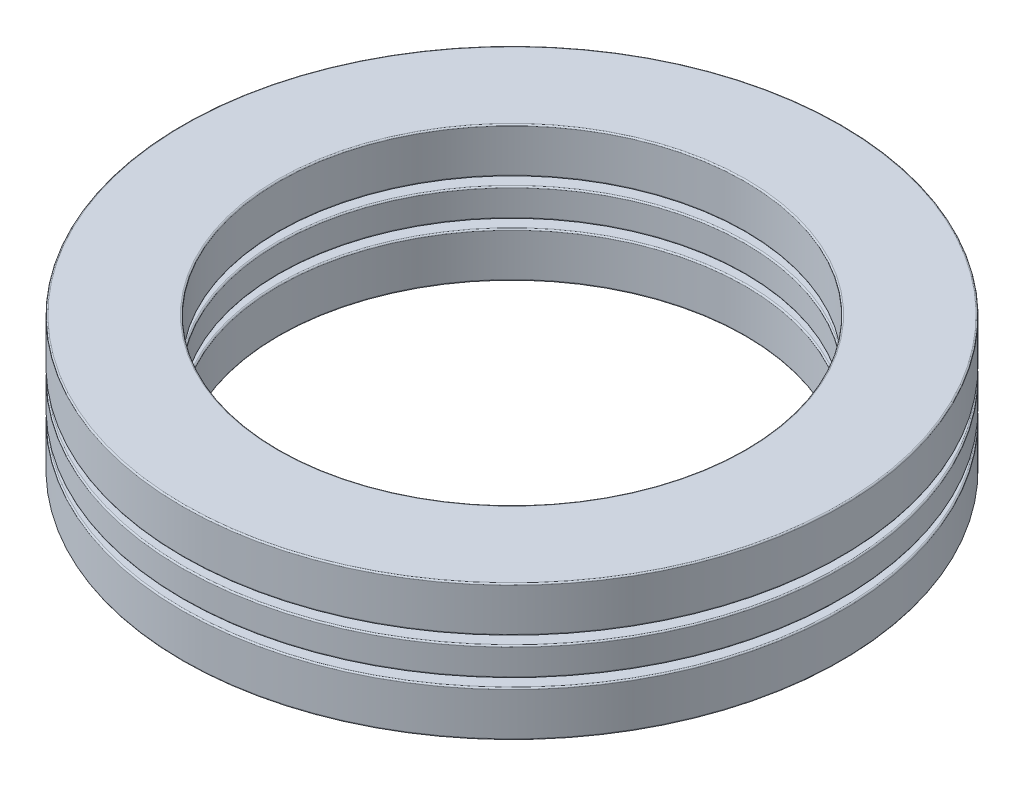
ISO-10303-21;
HEADER;
FILE_DESCRIPTION(('STEP AP214'),'2;1');
FILE_NAME('part.step','',(''),(''),'','','');
FILE_SCHEMA(('AUTOMOTIVE_DESIGN { 1 0 10303 214 1 1 1 1 }'));
ENDSEC;
DATA;
#1=APPLICATION_CONTEXT('core data for automotive mechanical design processes');
#2=APPLICATION_PROTOCOL_DEFINITION('international standard','automotive_design',2000,#1);
#3=PRODUCT_CONTEXT('',#1,'mechanical');
#4=PRODUCT('Part','Part','',(#3));
#5=PRODUCT_RELATED_PRODUCT_CATEGORY('part','',(#4));
#6=PRODUCT_DEFINITION_FORMATION('','',#4);
#7=PRODUCT_DEFINITION_CONTEXT('part definition',#1,'design');
#8=PRODUCT_DEFINITION('design','',#6,#7);
#9=PRODUCT_DEFINITION_SHAPE('','',#8);
#10=(LENGTH_UNIT() NAMED_UNIT(*) SI_UNIT(.MILLI.,.METRE.));
#11=(NAMED_UNIT(*) PLANE_ANGLE_UNIT() SI_UNIT($,.RADIAN.));
#12=(NAMED_UNIT(*) SI_UNIT($,.STERADIAN.) SOLID_ANGLE_UNIT());
#13=UNCERTAINTY_MEASURE_WITH_UNIT(LENGTH_MEASURE(1.E-05),#10,'distance_accuracy_value','');
#14=(GEOMETRIC_REPRESENTATION_CONTEXT(3) GLOBAL_UNCERTAINTY_ASSIGNED_CONTEXT((#13)) GLOBAL_UNIT_ASSIGNED_CONTEXT((#10,
#11,#12)) REPRESENTATION_CONTEXT('',''));
#15=CARTESIAN_POINT('',(0.,0.,0.));
#16=DIRECTION('',(0.,0.,1.));
#17=DIRECTION('',(1.,0.,0.));
#18=AXIS2_PLACEMENT_3D('',#15,#16,#17);
#19=CARTESIAN_POINT('',(0.,-5.5499,0.));
#20=DIRECTION('',(0.,-1.,0.));
#21=DIRECTION('',(0.,0.,-1.));
#22=AXIS2_PLACEMENT_3D('',#19,#20,#21);
#23=CYLINDRICAL_SURFACE('',#22,26.9875);
#24=CARTESIAN_POINT('',(0.,-5.438902,0.));
#25=DIRECTION('',(0.,1.,0.));
#26=DIRECTION('',(0.,0.,1.));
#27=AXIS2_PLACEMENT_3D('',#24,#25,#26);
#28=CIRCLE('',#27,26.9875);
#29=CARTESIAN_POINT('',(0.,-5.438902,26.9875));
#30=VERTEX_POINT('',#29);
#31=EDGE_CURVE('E11',#30,#30,#28,.T.);
#32=ORIENTED_EDGE('',*,*,#31,.T.);
#33=EDGE_LOOP('',(#32));
#34=FACE_BOUND('',#33,.T.);
#35=CARTESIAN_POINT('',(0.,-1.96096466666667,0.));
#36=DIRECTION('',(0.,-1.,0.));
#37=DIRECTION('',(0.,0.,-1.));
#38=AXIS2_PLACEMENT_3D('',#35,#36,#37);
#39=CIRCLE('',#38,26.9875);
#40=CARTESIAN_POINT('',(0.,-1.96096466666667,-26.9875));
#41=VERTEX_POINT('',#40);
#42=EDGE_CURVE('E48',#41,#41,#39,.T.);
#43=ORIENTED_EDGE('',*,*,#42,.T.);
#44=EDGE_LOOP('',(#43));
#45=FACE_BOUND('',#44,.T.);
#46=ADVANCED_FACE('F41',(#34,#45),#23,.T.);
#47=CARTESIAN_POINT('',(0.,-1.84996666666667,26.9875));
#48=DIRECTION('',(0.,-1.,0.));
#49=DIRECTION('',(0.,0.,-1.));
#50=AXIS2_PLACEMENT_3D('',#47,#48,#49);
#51=PLANE('',#50);
#52=CARTESIAN_POINT('',(0.,-1.84996666666667,0.));
#53=DIRECTION('',(0.,-1.,0.));
#54=DIRECTION('',(0.,0.,-1.));
#55=AXIS2_PLACEMENT_3D('',#52,#53,#54);
#56=CIRCLE('',#55,19.199098);
#57=CARTESIAN_POINT('',(0.,-1.84996666666667,-19.199098));
#58=VERTEX_POINT('',#57);
#59=EDGE_CURVE('E52',#58,#58,#56,.T.);
#60=ORIENTED_EDGE('',*,*,#59,.T.);
#61=EDGE_LOOP('',(#60));
#62=FACE_BOUND('',#61,.T.);
#63=CARTESIAN_POINT('',(0.,-1.84996666666667,0.));
#64=DIRECTION('',(0.,-1.,0.));
#65=DIRECTION('',(0.,0.,-1.));
#66=AXIS2_PLACEMENT_3D('',#63,#64,#65);
#67=CIRCLE('',#66,26.876502);
#68=CARTESIAN_POINT('',(0.,-1.84996666666667,-26.876502));
#69=VERTEX_POINT('',#68);
#70=EDGE_CURVE('E56',#69,#69,#67,.F.);
#71=ORIENTED_EDGE('',*,*,#70,.T.);
#72=EDGE_LOOP('',(#71));
#73=FACE_BOUND('',#72,.T.);
#74=ADVANCED_FACE('F84',(#62,#73),#51,.F.);
#75=CARTESIAN_POINT('',(0.,-5.5499,0.));
#76=DIRECTION('',(0.,-1.,0.));
#77=DIRECTION('',(0.,0.,-1.));
#78=AXIS2_PLACEMENT_3D('',#75,#76,#77);
#79=CYLINDRICAL_SURFACE('',#78,19.0881);
#80=CARTESIAN_POINT('',(0.,-5.438902,0.));
#81=DIRECTION('',(0.,1.,0.));
#82=DIRECTION('',(0.,0.,1.));
#83=AXIS2_PLACEMENT_3D('',#80,#81,#82);
#84=CIRCLE('',#83,19.0881);
#85=CARTESIAN_POINT('',(0.,-5.438902,19.0881));
#86=VERTEX_POINT('',#85);
#87=EDGE_CURVE('E67',#86,#86,#84,.F.);
#88=ORIENTED_EDGE('',*,*,#87,.T.);
#89=EDGE_LOOP('',(#88));
#90=FACE_BOUND('',#89,.T.);
#91=CARTESIAN_POINT('',(0.,-1.96096466666667,0.));
#92=DIRECTION('',(0.,-1.,0.));
#93=DIRECTION('',(0.,0.,-1.));
#94=AXIS2_PLACEMENT_3D('',#91,#92,#93);
#95=CIRCLE('',#94,19.0881);
#96=CARTESIAN_POINT('',(0.,-1.96096466666667,-19.0881));
#97=VERTEX_POINT('',#96);
#98=EDGE_CURVE('E70',#97,#97,#95,.F.);
#99=ORIENTED_EDGE('',*,*,#98,.T.);
#100=EDGE_LOOP('',(#99));
#101=FACE_BOUND('',#100,.T.);
#102=ADVANCED_FACE('F74',(#90,#101),#79,.F.);
#103=CARTESIAN_POINT('',(0.,-5.5499,26.9875));
#104=DIRECTION('',(0.,1.,0.));
#105=DIRECTION('',(0.,0.,1.));
#106=AXIS2_PLACEMENT_3D('',#103,#104,#105);
#107=PLANE('',#106);
#108=CARTESIAN_POINT('',(0.,-5.5499,0.));
#109=DIRECTION('',(0.,1.,0.));
#110=DIRECTION('',(0.,0.,1.));
#111=AXIS2_PLACEMENT_3D('',#108,#109,#110);
#112=CIRCLE('',#111,19.199098);
#113=CARTESIAN_POINT('',(0.,-5.5499,19.199098));
#114=VERTEX_POINT('',#113);
#115=EDGE_CURVE('E61',#114,#114,#112,.T.);
#116=ORIENTED_EDGE('',*,*,#115,.T.);
#117=EDGE_LOOP('',(#116));
#118=FACE_BOUND('',#117,.T.);
#119=CARTESIAN_POINT('',(0.,-5.5499,0.));
#120=DIRECTION('',(0.,1.,0.));
#121=DIRECTION('',(0.,0.,1.));
#122=AXIS2_PLACEMENT_3D('',#119,#120,#121);
#123=CIRCLE('',#122,26.876502);
#124=CARTESIAN_POINT('',(0.,-5.5499,26.876502));
#125=VERTEX_POINT('',#124);
#126=EDGE_CURVE('E64',#125,#125,#123,.F.);
#127=ORIENTED_EDGE('',*,*,#126,.T.);
#128=EDGE_LOOP('',(#127));
#129=FACE_BOUND('',#128,.T.);
#130=ADVANCED_FACE('F103',(#118,#129),#107,.F.);
#131=CARTESIAN_POINT('',(0.,-5.438902,0.));
#132=DIRECTION('',(0.,1.,0.));
#133=DIRECTION('',(0.,0.,1.));
#134=AXIS2_PLACEMENT_3D('',#131,#132,#133);
#135=TOROIDAL_SURFACE('',#134,19.199098,0.110998);
#136=ORIENTED_EDGE('',*,*,#115,.F.);
#137=EDGE_LOOP('',(#136));
#138=FACE_BOUND('',#137,.T.);
#139=ORIENTED_EDGE('',*,*,#87,.F.);
#140=EDGE_LOOP('',(#139));
#141=FACE_BOUND('',#140,.T.);
#142=ADVANCED_FACE('F80',(#138,#141),#135,.T.);
#143=CARTESIAN_POINT('',(0.,-1.96096466666667,0.));
#144=DIRECTION('',(0.,-1.,0.));
#145=DIRECTION('',(0.,0.,-1.));
#146=AXIS2_PLACEMENT_3D('',#143,#144,#145);
#147=TOROIDAL_SURFACE('',#146,19.199098,0.110998);
#148=ORIENTED_EDGE('',*,*,#98,.F.);
#149=EDGE_LOOP('',(#148));
#150=FACE_BOUND('',#149,.T.);
#151=ORIENTED_EDGE('',*,*,#59,.F.);
#152=EDGE_LOOP('',(#151));
#153=FACE_BOUND('',#152,.T.);
#154=ADVANCED_FACE('F76',(#150,#153),#147,.T.);
#155=CARTESIAN_POINT('',(0.,-5.438902,0.));
#156=DIRECTION('',(0.,1.,0.));
#157=DIRECTION('',(0.,0.,1.));
#158=AXIS2_PLACEMENT_3D('',#155,#156,#157);
#159=TOROIDAL_SURFACE('',#158,26.876502,0.110998);
#160=ORIENTED_EDGE('',*,*,#31,.F.);
#161=EDGE_LOOP('',(#160));
#162=FACE_BOUND('',#161,.T.);
#163=ORIENTED_EDGE('',*,*,#126,.F.);
#164=EDGE_LOOP('',(#163));
#165=FACE_BOUND('',#164,.T.);
#166=ADVANCED_FACE('F79',(#162,#165),#159,.T.);
#167=CARTESIAN_POINT('',(0.,-1.96096466666667,0.));
#168=DIRECTION('',(0.,-1.,0.));
#169=DIRECTION('',(0.,0.,-1.));
#170=AXIS2_PLACEMENT_3D('',#167,#168,#169);
#171=TOROIDAL_SURFACE('',#170,26.876502,0.110998);
#172=ORIENTED_EDGE('',*,*,#70,.F.);
#173=EDGE_LOOP('',(#172));
#174=FACE_BOUND('',#173,.T.);
#175=ORIENTED_EDGE('',*,*,#42,.F.);
#176=EDGE_LOOP('',(#175));
#177=FACE_BOUND('',#176,.T.);
#178=ADVANCED_FACE('F43',(#174,#177),#171,.T.);
#179=CLOSED_SHELL('',(#46,#74,#102,#130,#142,#154,#166,#178));
#180=MANIFOLD_SOLID_BREP('B2',#179);
#181=CARTESIAN_POINT('',(0.,-5.5499,0.));
#182=DIRECTION('',(0.,-1.,0.));
#183=DIRECTION('',(0.,0.,-1.));
#184=AXIS2_PLACEMENT_3D('',#181,#182,#183);
#185=CYLINDRICAL_SURFACE('',#184,26.9875);
#186=CARTESIAN_POINT('',(0.,1.96096466666667,0.));
#187=DIRECTION('',(0.,1.,0.));
#188=DIRECTION('',(0.,0.,1.));
#189=AXIS2_PLACEMENT_3D('',#186,#187,#188);
#190=CIRCLE('',#189,26.9875);
#191=CARTESIAN_POINT('',(0.,1.96096466666667,26.9875));
#192=VERTEX_POINT('',#191);
#193=EDGE_CURVE('E40',#192,#192,#190,.T.);
#194=ORIENTED_EDGE('',*,*,#193,.T.);
#195=EDGE_LOOP('',(#194));
#196=FACE_BOUND('',#195,.T.);
#197=CARTESIAN_POINT('',(0.,5.438902,0.));
#198=DIRECTION('',(0.,-1.,0.));
#199=DIRECTION('',(0.,0.,-1.));
#200=AXIS2_PLACEMENT_3D('',#197,#198,#199);
#201=CIRCLE('',#200,26.9875);
#202=CARTESIAN_POINT('',(0.,5.438902,-26.9875));
#203=VERTEX_POINT('',#202);
#204=EDGE_CURVE('E175',#203,#203,#201,.T.);
#205=ORIENTED_EDGE('',*,*,#204,.T.);
#206=EDGE_LOOP('',(#205));
#207=FACE_BOUND('',#206,.T.);
#208=ADVANCED_FACE('F168',(#196,#207),#185,.T.);
#209=CARTESIAN_POINT('',(0.,5.5499,26.9875));
#210=DIRECTION('',(0.,-1.,0.));
#211=DIRECTION('',(0.,0.,-1.));
#212=AXIS2_PLACEMENT_3D('',#209,#210,#211);
#213=PLANE('',#212);
#214=CARTESIAN_POINT('',(0.,5.5499,0.));
#215=DIRECTION('',(0.,-1.,0.));
#216=DIRECTION('',(0.,0.,-1.));
#217=AXIS2_PLACEMENT_3D('',#214,#215,#216);
#218=CIRCLE('',#217,19.199098);
#219=CARTESIAN_POINT('',(0.,5.5499,-19.199098));
#220=VERTEX_POINT('',#219);
#221=EDGE_CURVE('E179',#220,#220,#218,.T.);
#222=ORIENTED_EDGE('',*,*,#221,.T.);
#223=EDGE_LOOP('',(#222));
#224=FACE_BOUND('',#223,.T.);
#225=CARTESIAN_POINT('',(0.,5.5499,0.));
#226=DIRECTION('',(0.,-1.,0.));
#227=DIRECTION('',(0.,0.,-1.));
#228=AXIS2_PLACEMENT_3D('',#225,#226,#227);
#229=CIRCLE('',#228,26.876502);
#230=CARTESIAN_POINT('',(0.,5.5499,-26.876502));
#231=VERTEX_POINT('',#230);
#232=EDGE_CURVE('E183',#231,#231,#229,.F.);
#233=ORIENTED_EDGE('',*,*,#232,.T.);
#234=EDGE_LOOP('',(#233));
#235=FACE_BOUND('',#234,.T.);
#236=ADVANCED_FACE('F211',(#224,#235),#213,.F.);
#237=CARTESIAN_POINT('',(0.,-5.5499,0.));
#238=DIRECTION('',(0.,-1.,0.));
#239=DIRECTION('',(0.,0.,-1.));
#240=AXIS2_PLACEMENT_3D('',#237,#238,#239);
#241=CYLINDRICAL_SURFACE('',#240,19.0881);
#242=CARTESIAN_POINT('',(0.,1.96096466666667,0.));
#243=DIRECTION('',(0.,1.,0.));
#244=DIRECTION('',(0.,0.,1.));
#245=AXIS2_PLACEMENT_3D('',#242,#243,#244);
#246=CIRCLE('',#245,19.0881);
#247=CARTESIAN_POINT('',(0.,1.96096466666667,19.0881));
#248=VERTEX_POINT('',#247);
#249=EDGE_CURVE('E194',#248,#248,#246,.F.);
#250=ORIENTED_EDGE('',*,*,#249,.T.);
#251=EDGE_LOOP('',(#250));
#252=FACE_BOUND('',#251,.T.);
#253=CARTESIAN_POINT('',(0.,5.438902,0.));
#254=DIRECTION('',(0.,-1.,0.));
#255=DIRECTION('',(0.,0.,-1.));
#256=AXIS2_PLACEMENT_3D('',#253,#254,#255);
#257=CIRCLE('',#256,19.0881);
#258=CARTESIAN_POINT('',(0.,5.438902,-19.0881));
#259=VERTEX_POINT('',#258);
#260=EDGE_CURVE('E197',#259,#259,#257,.F.);
#261=ORIENTED_EDGE('',*,*,#260,.T.);
#262=EDGE_LOOP('',(#261));
#263=FACE_BOUND('',#262,.T.);
#264=ADVANCED_FACE('F201',(#252,#263),#241,.F.);
#265=CARTESIAN_POINT('',(0.,1.84996666666667,26.9875));
#266=DIRECTION('',(0.,1.,0.));
#267=DIRECTION('',(0.,0.,1.));
#268=AXIS2_PLACEMENT_3D('',#265,#266,#267);
#269=PLANE('',#268);
#270=CARTESIAN_POINT('',(0.,1.84996666666667,0.));
#271=DIRECTION('',(0.,1.,0.));
#272=DIRECTION('',(0.,0.,1.));
#273=AXIS2_PLACEMENT_3D('',#270,#271,#272);
#274=CIRCLE('',#273,19.199098);
#275=CARTESIAN_POINT('',(0.,1.84996666666667,19.199098));
#276=VERTEX_POINT('',#275);
#277=EDGE_CURVE('E188',#276,#276,#274,.T.);
#278=ORIENTED_EDGE('',*,*,#277,.T.);
#279=EDGE_LOOP('',(#278));
#280=FACE_BOUND('',#279,.T.);
#281=CARTESIAN_POINT('',(0.,1.84996666666667,0.));
#282=DIRECTION('',(0.,1.,0.));
#283=DIRECTION('',(0.,0.,1.));
#284=AXIS2_PLACEMENT_3D('',#281,#282,#283);
#285=CIRCLE('',#284,26.876502);
#286=CARTESIAN_POINT('',(0.,1.84996666666667,26.876502));
#287=VERTEX_POINT('',#286);
#288=EDGE_CURVE('E191',#287,#287,#285,.F.);
#289=ORIENTED_EDGE('',*,*,#288,.T.);
#290=EDGE_LOOP('',(#289));
#291=FACE_BOUND('',#290,.T.);
#292=ADVANCED_FACE('F230',(#280,#291),#269,.F.);
#293=CARTESIAN_POINT('',(0.,1.96096466666667,0.));
#294=DIRECTION('',(0.,1.,0.));
#295=DIRECTION('',(0.,0.,1.));
#296=AXIS2_PLACEMENT_3D('',#293,#294,#295);
#297=TOROIDAL_SURFACE('',#296,19.199098,0.110998);
#298=ORIENTED_EDGE('',*,*,#277,.F.);
#299=EDGE_LOOP('',(#298));
#300=FACE_BOUND('',#299,.T.);
#301=ORIENTED_EDGE('',*,*,#249,.F.);
#302=EDGE_LOOP('',(#301));
#303=FACE_BOUND('',#302,.T.);
#304=ADVANCED_FACE('F207',(#300,#303),#297,.T.);
#305=CARTESIAN_POINT('',(0.,5.438902,0.));
#306=DIRECTION('',(0.,-1.,0.));
#307=DIRECTION('',(0.,0.,-1.));
#308=AXIS2_PLACEMENT_3D('',#305,#306,#307);
#309=TOROIDAL_SURFACE('',#308,19.199098,0.110998);
#310=ORIENTED_EDGE('',*,*,#260,.F.);
#311=EDGE_LOOP('',(#310));
#312=FACE_BOUND('',#311,.T.);
#313=ORIENTED_EDGE('',*,*,#221,.F.);
#314=EDGE_LOOP('',(#313));
#315=FACE_BOUND('',#314,.T.);
#316=ADVANCED_FACE('F203',(#312,#315),#309,.T.);
#317=CARTESIAN_POINT('',(0.,1.96096466666667,0.));
#318=DIRECTION('',(0.,1.,0.));
#319=DIRECTION('',(0.,0.,1.));
#320=AXIS2_PLACEMENT_3D('',#317,#318,#319);
#321=TOROIDAL_SURFACE('',#320,26.876502,0.110998);
#322=ORIENTED_EDGE('',*,*,#193,.F.);
#323=EDGE_LOOP('',(#322));
#324=FACE_BOUND('',#323,.T.);
#325=ORIENTED_EDGE('',*,*,#288,.F.);
#326=EDGE_LOOP('',(#325));
#327=FACE_BOUND('',#326,.T.);
#328=ADVANCED_FACE('F206',(#324,#327),#321,.T.);
#329=CARTESIAN_POINT('',(0.,5.438902,0.));
#330=DIRECTION('',(0.,-1.,0.));
#331=DIRECTION('',(0.,0.,-1.));
#332=AXIS2_PLACEMENT_3D('',#329,#330,#331);
#333=TOROIDAL_SURFACE('',#332,26.876502,0.110998);
#334=ORIENTED_EDGE('',*,*,#232,.F.);
#335=EDGE_LOOP('',(#334));
#336=FACE_BOUND('',#335,.T.);
#337=ORIENTED_EDGE('',*,*,#204,.F.);
#338=EDGE_LOOP('',(#337));
#339=FACE_BOUND('',#338,.T.);
#340=ADVANCED_FACE('F170',(#336,#339),#333,.T.);
#341=CLOSED_SHELL('',(#208,#236,#264,#292,#304,#316,#328,#340));
#342=MANIFOLD_SOLID_BREP('B6',#341);
#343=CARTESIAN_POINT('',(-12.4551750243783,0.,19.3806306386583));
#344=DIRECTION('',(0.,1.,0.));
#345=DIRECTION('',(0.540640817455587,0.,-0.841253532831188));
#346=AXIS2_PLACEMENT_3D('',#343,#344,#345);
#347=SPHERICAL_SURFACE('',#346,1.84996666666667);
#348=CARTESIAN_POINT('',(-12.4551750243783,1.84996666666667,19.3806306386583));
#349=VERTEX_POINT('',#348);
#350=VERTEX_LOOP('',#349);
#351=FACE_BOUND('',#350,.T.);
#352=ADVANCED_FACE('F295',(#351),#347,.T.);
#353=CLOSED_SHELL('',(#352));
#354=MANIFOLD_SOLID_BREP('B35',#353);
#355=CARTESIAN_POINT('',(-20.9559199825782,0.,9.57024798653509));
#356=DIRECTION('',(0.,1.,0.));
#357=DIRECTION('',(0.909631995354514,0.,-0.415415013001897));
#358=AXIS2_PLACEMENT_3D('',#355,#356,#357);
#359=SPHERICAL_SURFACE('',#358,1.84996666666667);
#360=CARTESIAN_POINT('',(-20.9559199825782,1.84996666666667,9.57024798653509));
#361=VERTEX_POINT('',#360);
#362=VERTEX_LOOP('',#361);
#363=FACE_BOUND('',#362,.T.);
#364=ADVANCED_FACE('F313',(#363),#359,.T.);
#365=CLOSED_SHELL('',(#364));
#366=MANIFOLD_SOLID_BREP('B164',#365);
#367=CARTESIAN_POINT('',(-22.8033084137646,0.,-3.27862078117207));
#368=DIRECTION('',(0.,1.,0.));
#369=DIRECTION('',(0.989821441880934,0.,0.142314838273276));
#370=AXIS2_PLACEMENT_3D('',#367,#368,#369);
#371=SPHERICAL_SURFACE('',#370,1.84996666666667);
#372=CARTESIAN_POINT('',(-22.8033084137646,1.84996666666667,-3.27862078117207));
#373=VERTEX_POINT('',#372);
#374=VERTEX_LOOP('',#373);
#375=FACE_BOUND('',#374,.T.);
#376=ADVANCED_FACE('F331',(#375),#371,.T.);
#377=CLOSED_SHELL('',(#376));
#378=MANIFOLD_SOLID_BREP('B291',#377);
#379=CARTESIAN_POINT('',(-17.4108075440587,0.,-15.0865506164845));
#380=DIRECTION('',(0.,1.,0.));
#381=DIRECTION('',(0.755749574354264,0.,0.654860733945279));
#382=AXIS2_PLACEMENT_3D('',#379,#380,#381);
#383=SPHERICAL_SURFACE('',#382,1.84996666666667);
#384=CARTESIAN_POINT('',(-17.4108075440587,1.84996666666667,-15.0865506164845));
#385=VERTEX_POINT('',#384);
#386=VERTEX_LOOP('',#385);
#387=FACE_BOUND('',#386,.T.);
#388=ADVANCED_FACE('F349',(#387),#383,.T.);
#389=CLOSED_SHELL('',(#388));
#390=MANIFOLD_SOLID_BREP('B309',#389);
#391=CARTESIAN_POINT('',(-6.49049829800165,0.,-22.104607227536));
#392=DIRECTION('',(0.,1.,0.));
#393=DIRECTION('',(0.281732556841437,0.,0.959492973614495));
#394=AXIS2_PLACEMENT_3D('',#391,#392,#393);
#395=SPHERICAL_SURFACE('',#394,1.84996666666667);
#396=CARTESIAN_POINT('',(-6.49049829800165,1.84996666666667,-22.104607227536));
#397=VERTEX_POINT('',#396);
#398=VERTEX_LOOP('',#397);
#399=FACE_BOUND('',#398,.T.);
#400=ADVANCED_FACE('F367',(#399),#395,.T.);
#401=CLOSED_SHELL('',(#400));
#402=MANIFOLD_SOLID_BREP('B327',#401);
#403=CARTESIAN_POINT('',(6.49049829800135,0.,-22.1046072275361));
#404=DIRECTION('',(0.,1.,0.));
#405=DIRECTION('',(-0.281732556841424,0.,0.959492973614499));
#406=AXIS2_PLACEMENT_3D('',#403,#404,#405);
#407=SPHERICAL_SURFACE('',#406,1.84996666666667);
#408=CARTESIAN_POINT('',(6.49049829800135,1.84996666666667,-22.1046072275361));
#409=VERTEX_POINT('',#408);
#410=VERTEX_LOOP('',#409);
#411=FACE_BOUND('',#410,.T.);
#412=ADVANCED_FACE('F385',(#411),#407,.T.);
#413=CLOSED_SHELL('',(#412));
#414=MANIFOLD_SOLID_BREP('B345',#413);
#415=CARTESIAN_POINT('',(17.4108075440585,0.,-15.0865506164848));
#416=DIRECTION('',(0.,1.,0.));
#417=DIRECTION('',(-0.755749574354255,0.,0.654860733945289));
#418=AXIS2_PLACEMENT_3D('',#415,#416,#417);
#419=SPHERICAL_SURFACE('',#418,1.84996666666667);
#420=CARTESIAN_POINT('',(17.4108075440585,1.84996666666667,-15.0865506164848));
#421=VERTEX_POINT('',#420);
#422=VERTEX_LOOP('',#421);
#423=FACE_BOUND('',#422,.T.);
#424=ADVANCED_FACE('F403',(#423),#419,.T.);
#425=CLOSED_SHELL('',(#424));
#426=MANIFOLD_SOLID_BREP('B363',#425);
#427=CARTESIAN_POINT('',(22.8033084137645,0.,-3.27862078117237));
#428=DIRECTION('',(0.,1.,0.));
#429=DIRECTION('',(-0.989821441880932,0.,0.142314838273289));
#430=AXIS2_PLACEMENT_3D('',#427,#428,#429);
#431=SPHERICAL_SURFACE('',#430,1.84996666666667);
#432=CARTESIAN_POINT('',(22.8033084137645,1.84996666666667,-3.27862078117237));
#433=VERTEX_POINT('',#432);
#434=VERTEX_LOOP('',#433);
#435=FACE_BOUND('',#434,.T.);
#436=ADVANCED_FACE('F421',(#435),#431,.T.);
#437=CLOSED_SHELL('',(#436));
#438=MANIFOLD_SOLID_BREP('B381',#437);
#439=CARTESIAN_POINT('',(20.9559199825783,0.,9.57024798653481));
#440=DIRECTION('',(0.,1.,0.));
#441=DIRECTION('',(-0.90963199535452,0.,-0.415415013001884));
#442=AXIS2_PLACEMENT_3D('',#439,#440,#441);
#443=SPHERICAL_SURFACE('',#442,1.84996666666667);
#444=CARTESIAN_POINT('',(20.9559199825783,1.84996666666667,9.57024798653481));
#445=VERTEX_POINT('',#444);
#446=VERTEX_LOOP('',#445);
#447=FACE_BOUND('',#446,.T.);
#448=ADVANCED_FACE('F439',(#447),#443,.T.);
#449=CLOSED_SHELL('',(#448));
#450=MANIFOLD_SOLID_BREP('B399',#449);
#451=CARTESIAN_POINT('',(12.4551750243786,0.,19.3806306386582));
#452=DIRECTION('',(0.,1.,0.));
#453=DIRECTION('',(-0.540640817455599,0.,-0.841253532831181));
#454=AXIS2_PLACEMENT_3D('',#451,#452,#453);
#455=SPHERICAL_SURFACE('',#454,1.84996666666667);
#456=CARTESIAN_POINT('',(12.4551750243786,1.84996666666667,19.3806306386582));
#457=VERTEX_POINT('',#456);
#458=VERTEX_LOOP('',#457);
#459=FACE_BOUND('',#458,.T.);
#460=ADVANCED_FACE('F457',(#459),#455,.T.);
#461=CLOSED_SHELL('',(#460));
#462=MANIFOLD_SOLID_BREP('B417',#461);
#463=CARTESIAN_POINT('',(0.,0.,23.0378));
#464=DIRECTION('',(0.,1.,0.));
#465=DIRECTION('',(0.,0.,-1.));
#466=AXIS2_PLACEMENT_3D('',#463,#464,#465);
#467=SPHERICAL_SURFACE('',#466,1.84996666666667);
#468=CARTESIAN_POINT('',(0.,1.84996666666667,23.0378));
#469=VERTEX_POINT('',#468);
#470=VERTEX_LOOP('',#469);
#471=FACE_BOUND('',#470,.T.);
#472=ADVANCED_FACE('F476',(#471),#467,.T.);
#473=CLOSED_SHELL('',(#472));
#474=MANIFOLD_SOLID_BREP('B435',#473);
#475=CARTESIAN_POINT('',(0.,-5.5499,0.));
#476=DIRECTION('',(0.,-1.,0.));
#477=DIRECTION('',(0.,0.,-1.));
#478=AXIS2_PLACEMENT_3D('',#475,#476,#477);
#479=CYLINDRICAL_SURFACE('',#478,26.9875);
#480=CARTESIAN_POINT('',(0.,-1.04523116666667,0.));
#481=DIRECTION('',(0.,1.,0.));
#482=DIRECTION('',(0.,0.,1.));
#483=AXIS2_PLACEMENT_3D('',#480,#481,#482);
#484=CIRCLE('',#483,26.9875);
#485=CARTESIAN_POINT('',(0.,-1.04523116666667,26.9875));
#486=VERTEX_POINT('',#485);
#487=EDGE_CURVE('E475',#486,#486,#484,.T.);
#488=ORIENTED_EDGE('',*,*,#487,.T.);
#489=EDGE_LOOP('',(#488));
#490=FACE_BOUND('',#489,.T.);
#491=CARTESIAN_POINT('',(0.,1.04523116666667,0.));
#492=DIRECTION('',(0.,-1.,0.));
#493=DIRECTION('',(0.,0.,-1.));
#494=AXIS2_PLACEMENT_3D('',#491,#492,#493);
#495=CIRCLE('',#494,26.9875);
#496=CARTESIAN_POINT('',(0.,1.04523116666667,-26.9875));
#497=VERTEX_POINT('',#496);
#498=EDGE_CURVE('E495',#497,#497,#495,.T.);
#499=ORIENTED_EDGE('',*,*,#498,.T.);
#500=EDGE_LOOP('',(#499));
#501=FACE_BOUND('',#500,.T.);
#502=ADVANCED_FACE('F488',(#490,#501),#479,.T.);
#503=CARTESIAN_POINT('',(0.,-1.15622916666667,26.9875));
#504=DIRECTION('',(0.,1.,0.));
#505=DIRECTION('',(0.,0.,1.));
#506=AXIS2_PLACEMENT_3D('',#503,#504,#505);
#507=PLANE('',#506);
#508=CARTESIAN_POINT('',(0.,-1.15622916666667,0.));
#509=DIRECTION('',(0.,1.,0.));
#510=DIRECTION('',(0.,0.,1.));
#511=AXIS2_PLACEMENT_3D('',#508,#509,#510);
#512=CIRCLE('',#511,19.199098);
#513=CARTESIAN_POINT('',(0.,-1.15622916666667,19.199098));
#514=VERTEX_POINT('',#513);
#515=EDGE_CURVE('E508',#514,#514,#512,.T.);
#516=ORIENTED_EDGE('',*,*,#515,.T.);
#517=EDGE_LOOP('',(#516));
#518=FACE_BOUND('',#517,.T.);
#519=CARTESIAN_POINT('',(0.,-1.15622916666667,0.));
#520=DIRECTION('',(0.,1.,0.));
#521=DIRECTION('',(0.,0.,1.));
#522=AXIS2_PLACEMENT_3D('',#519,#520,#521);
#523=CIRCLE('',#522,26.876502);
#524=CARTESIAN_POINT('',(0.,-1.15622916666667,26.876502));
#525=VERTEX_POINT('',#524);
#526=EDGE_CURVE('E511',#525,#525,#523,.F.);
#527=ORIENTED_EDGE('',*,*,#526,.T.);
#528=EDGE_LOOP('',(#527));
#529=FACE_BOUND('',#528,.T.);
#530=CARTESIAN_POINT('',(-12.4551750243783,-1.15622916666667,19.3806306386583));
#531=DIRECTION('',(0.,1.,0.));
#532=DIRECTION('',(-0.540640817455587,0.,0.841253532831188));
#533=AXIS2_PLACEMENT_3D('',#530,#531,#532);
#534=CIRCLE('',#533,1.44412976630463);
#535=CARTESIAN_POINT('',(-13.2359305217452,-1.15622916666667,20.5955099064288));
#536=VERTEX_POINT('',#535);
#537=EDGE_CURVE('E580',#536,#536,#534,.T.);
#538=ORIENTED_EDGE('',*,*,#537,.T.);
#539=EDGE_LOOP('',(#538));
#540=FACE_BOUND('',#539,.T.);
#541=CARTESIAN_POINT('',(-20.9559199825782,-1.15622916666667,9.57024798653509));
#542=DIRECTION('',(0.,1.,0.));
#543=DIRECTION('',(-0.909631995354514,0.,0.415415013001897));
#544=AXIS2_PLACEMENT_3D('',#541,#542,#543);
#545=CIRCLE('',#544,1.44412976630463);
#546=CARTESIAN_POINT('',(-22.2695466234527,-1.15622916666667,10.170161172181));
#547=VERTEX_POINT('',#546);
#548=EDGE_CURVE('E574',#547,#547,#545,.T.);
#549=ORIENTED_EDGE('',*,*,#548,.T.);
#550=EDGE_LOOP('',(#549));
#551=FACE_BOUND('',#550,.T.);
#552=CARTESIAN_POINT('',(-22.8033084137646,-1.15622916666667,-3.27862078117207));
#553=DIRECTION('',(0.,1.,0.));
#554=DIRECTION('',(-0.989821441880934,0.,-0.142314838273276));
#555=AXIS2_PLACEMENT_3D('',#552,#553,#554);
#556=CIRCLE('',#555,1.44412976630463);
#557=CARTESIAN_POINT('',(-24.2327390213114,-1.15622916666667,-3.48414187530933));
#558=VERTEX_POINT('',#557);
#559=EDGE_CURVE('E568',#558,#558,#556,.T.);
#560=ORIENTED_EDGE('',*,*,#559,.T.);
#561=EDGE_LOOP('',(#560));
#562=FACE_BOUND('',#561,.T.);
#563=CARTESIAN_POINT('',(-17.4108075440587,-1.15622916666667,-15.0865506164845));
#564=DIRECTION('',(0.,1.,0.));
#565=DIRECTION('',(-0.755749574354264,0.,-0.654860733945279));
#566=AXIS2_PLACEMENT_3D('',#563,#564,#565);
#567=CIRCLE('',#566,1.44412976630463);
#568=CARTESIAN_POINT('',(-18.5022080002557,-1.15622916666667,-16.032254495159));
#569=VERTEX_POINT('',#568);
#570=EDGE_CURVE('E562',#569,#569,#567,.T.);
#571=ORIENTED_EDGE('',*,*,#570,.T.);
#572=EDGE_LOOP('',(#571));
#573=FACE_BOUND('',#572,.T.);
#574=CARTESIAN_POINT('',(-6.49049829800165,-1.15622916666667,-22.104607227536));
#575=DIRECTION('',(0.,1.,0.));
#576=DIRECTION('',(-0.281732556841437,0.,-0.959492973614495));
#577=AXIS2_PLACEMENT_3D('',#574,#575,#576);
#578=CIRCLE('',#577,1.44412976630463);
#579=CARTESIAN_POINT('',(-6.89735666947348,-1.15622916666667,-23.4902395912929));
#580=VERTEX_POINT('',#579);
#581=EDGE_CURVE('E556',#580,#580,#578,.T.);
#582=ORIENTED_EDGE('',*,*,#581,.T.);
#583=EDGE_LOOP('',(#582));
#584=FACE_BOUND('',#583,.T.);
#585=CARTESIAN_POINT('',(6.49049829800135,-1.15622916666667,-22.1046072275361));
#586=DIRECTION('',(0.,1.,0.));
#587=DIRECTION('',(0.281732556841424,0.,-0.959492973614499));
#588=AXIS2_PLACEMENT_3D('',#585,#586,#587);
#589=CIRCLE('',#588,1.44412976630463);
#590=CARTESIAN_POINT('',(6.89735666947316,-1.15622916666667,-23.490239591293));
#591=VERTEX_POINT('',#590);
#592=EDGE_CURVE('E550',#591,#591,#589,.T.);
#593=ORIENTED_EDGE('',*,*,#592,.T.);
#594=EDGE_LOOP('',(#593));
#595=FACE_BOUND('',#594,.T.);
#596=CARTESIAN_POINT('',(17.4108075440585,-1.15622916666667,-15.0865506164848));
#597=DIRECTION('',(0.,1.,0.));
#598=DIRECTION('',(0.755749574354255,0.,-0.654860733945289));
#599=AXIS2_PLACEMENT_3D('',#596,#597,#598);
#600=CIRCLE('',#599,1.44412976630463);
#601=CARTESIAN_POINT('',(18.5022080002555,-1.15622916666667,-16.0322544951593));
#602=VERTEX_POINT('',#601);
#603=EDGE_CURVE('E544',#602,#602,#600,.T.);
#604=ORIENTED_EDGE('',*,*,#603,.T.);
#605=EDGE_LOOP('',(#604));
#606=FACE_BOUND('',#605,.T.);
#607=CARTESIAN_POINT('',(22.8033084137645,-1.15622916666667,-3.27862078117237));
#608=DIRECTION('',(0.,1.,0.));
#609=DIRECTION('',(0.989821441880932,0.,-0.142314838273289));
#610=AXIS2_PLACEMENT_3D('',#607,#608,#609);
#611=CIRCLE('',#610,1.44412976630463);
#612=CARTESIAN_POINT('',(24.2327390213114,-1.15622916666667,-3.48414187530966));
#613=VERTEX_POINT('',#612);
#614=EDGE_CURVE('E538',#613,#613,#611,.T.);
#615=ORIENTED_EDGE('',*,*,#614,.T.);
#616=EDGE_LOOP('',(#615));
#617=FACE_BOUND('',#616,.T.);
#618=CARTESIAN_POINT('',(20.9559199825783,-1.15622916666667,9.57024798653481));
#619=DIRECTION('',(0.,1.,0.));
#620=DIRECTION('',(0.90963199535452,0.,0.415415013001884));
#621=AXIS2_PLACEMENT_3D('',#618,#619,#620);
#622=CIRCLE('',#621,1.44412976630463);
#623=CARTESIAN_POINT('',(22.2695466234529,-1.15622916666667,10.1701611721807));
#624=VERTEX_POINT('',#623);
#625=EDGE_CURVE('E532',#624,#624,#622,.T.);
#626=ORIENTED_EDGE('',*,*,#625,.T.);
#627=EDGE_LOOP('',(#626));
#628=FACE_BOUND('',#627,.T.);
#629=CARTESIAN_POINT('',(12.4551750243786,-1.15622916666667,19.3806306386582));
#630=DIRECTION('',(0.,1.,0.));
#631=DIRECTION('',(0.540640817455599,0.,0.841253532831181));
#632=AXIS2_PLACEMENT_3D('',#629,#630,#631);
#633=CIRCLE('',#632,1.44412976630463);
#634=CARTESIAN_POINT('',(13.2359305217455,-1.15622916666667,20.5955099064286));
#635=VERTEX_POINT('',#634);
#636=EDGE_CURVE('E524',#635,#635,#633,.T.);
#637=ORIENTED_EDGE('',*,*,#636,.T.);
#638=EDGE_LOOP('',(#637));
#639=FACE_BOUND('',#638,.T.);
#640=CARTESIAN_POINT('',(0.,-1.15622916666667,23.0378));
#641=DIRECTION('',(0.,1.,0.));
#642=DIRECTION('',(0.,0.,1.));
#643=AXIS2_PLACEMENT_3D('',#640,#641,#642);
#644=CIRCLE('',#643,1.44412976630463);
#645=CARTESIAN_POINT('',(0.,-1.15622916666667,24.4819297663046));
#646=VERTEX_POINT('',#645);
#647=EDGE_CURVE('E520',#646,#646,#644,.T.);
#648=ORIENTED_EDGE('',*,*,#647,.T.);
#649=EDGE_LOOP('',(#648));
#650=FACE_BOUND('',#649,.T.);
#651=ADVANCED_FACE('F598',(#518,#529,#540,#551,#562,#573,#584,#595,#606,#617,#628,#639,#650),
#507,.F.);
#652=CARTESIAN_POINT('',(0.,-5.5499,0.));
#653=DIRECTION('',(0.,-1.,0.));
#654=DIRECTION('',(0.,0.,-1.));
#655=AXIS2_PLACEMENT_3D('',#652,#653,#654);
#656=CYLINDRICAL_SURFACE('',#655,19.0881);
#657=CARTESIAN_POINT('',(0.,-1.04523116666667,0.));
#658=DIRECTION('',(0.,1.,0.));
#659=DIRECTION('',(0.,0.,1.));
#660=AXIS2_PLACEMENT_3D('',#657,#658,#659);
#661=CIRCLE('',#660,19.0881);
#662=CARTESIAN_POINT('',(0.,-1.04523116666667,19.0881));
#663=VERTEX_POINT('',#662);
#664=EDGE_CURVE('E514',#663,#663,#661,.F.);
#665=ORIENTED_EDGE('',*,*,#664,.T.);
#666=EDGE_LOOP('',(#665));
#667=FACE_BOUND('',#666,.T.);
#668=CARTESIAN_POINT('',(0.,1.04523116666667,0.));
#669=DIRECTION('',(0.,-1.,0.));
#670=DIRECTION('',(0.,0.,-1.));
#671=AXIS2_PLACEMENT_3D('',#668,#669,#670);
#672=CIRCLE('',#671,19.0881);
#673=CARTESIAN_POINT('',(0.,1.04523116666667,-19.0881));
#674=VERTEX_POINT('',#673);
#675=EDGE_CURVE('E517',#674,#674,#672,.F.);
#676=ORIENTED_EDGE('',*,*,#675,.T.);
#677=EDGE_LOOP('',(#676));
#678=FACE_BOUND('',#677,.T.);
#679=ADVANCED_FACE('F601',(#667,#678),#656,.F.);
#680=CARTESIAN_POINT('',(0.,1.15622916666667,26.9875));
#681=DIRECTION('',(0.,-1.,0.));
#682=DIRECTION('',(0.,0.,-1.));
#683=AXIS2_PLACEMENT_3D('',#680,#681,#682);
#684=PLANE('',#683);
#685=CARTESIAN_POINT('',(0.,1.15622916666667,0.));
#686=DIRECTION('',(0.,-1.,0.));
#687=DIRECTION('',(0.,0.,-1.));
#688=AXIS2_PLACEMENT_3D('',#685,#686,#687);
#689=CIRCLE('',#688,19.199098);
#690=CARTESIAN_POINT('',(0.,1.15622916666667,-19.199098));
#691=VERTEX_POINT('',#690);
#692=EDGE_CURVE('E499',#691,#691,#689,.T.);
#693=ORIENTED_EDGE('',*,*,#692,.T.);
#694=EDGE_LOOP('',(#693));
#695=FACE_BOUND('',#694,.T.);
#696=CARTESIAN_POINT('',(0.,1.15622916666667,0.));
#697=DIRECTION('',(0.,-1.,0.));
#698=DIRECTION('',(0.,0.,-1.));
#699=AXIS2_PLACEMENT_3D('',#696,#697,#698);
#700=CIRCLE('',#699,26.876502);
#701=CARTESIAN_POINT('',(0.,1.15622916666667,-26.876502));
#702=VERTEX_POINT('',#701);
#703=EDGE_CURVE('E503',#702,#702,#700,.F.);
#704=ORIENTED_EDGE('',*,*,#703,.T.);
#705=EDGE_LOOP('',(#704));
#706=FACE_BOUND('',#705,.T.);
#707=CARTESIAN_POINT('',(-12.4551750243783,1.15622916666667,19.3806306386583));
#708=DIRECTION('',(0.,-1.,0.));
#709=DIRECTION('',(0.540640817455587,0.,-0.841253532831188));
#710=AXIS2_PLACEMENT_3D('',#707,#708,#709);
#711=CIRCLE('',#710,1.44412976630464);
#712=CARTESIAN_POINT('',(-11.6744195270114,1.15622916666667,18.1657513708879));
#713=VERTEX_POINT('',#712);
#714=EDGE_CURVE('E583',#713,#713,#711,.T.);
#715=ORIENTED_EDGE('',*,*,#714,.T.);
#716=EDGE_LOOP('',(#715));
#717=FACE_BOUND('',#716,.T.);
#718=CARTESIAN_POINT('',(-20.9559199825782,1.15622916666667,9.57024798653509));
#719=DIRECTION('',(0.,-1.,0.));
#720=DIRECTION('',(0.909631995354514,0.,-0.415415013001897));
#721=AXIS2_PLACEMENT_3D('',#718,#719,#720);
#722=CIRCLE('',#721,1.44412976630464);
#723=CARTESIAN_POINT('',(-19.6422933417037,1.15622916666667,8.97033480088922));
#724=VERTEX_POINT('',#723);
#725=EDGE_CURVE('E577',#724,#724,#722,.T.);
#726=ORIENTED_EDGE('',*,*,#725,.T.);
#727=EDGE_LOOP('',(#726));
#728=FACE_BOUND('',#727,.T.);
#729=CARTESIAN_POINT('',(-22.8033084137646,1.15622916666667,-3.27862078117207));
#730=DIRECTION('',(0.,-1.,0.));
#731=DIRECTION('',(0.989821441880934,0.,0.142314838273276));
#732=AXIS2_PLACEMENT_3D('',#729,#730,#731);
#733=CIRCLE('',#732,1.44412976630464);
#734=CARTESIAN_POINT('',(-21.3738778062178,1.15622916666667,-3.0730996870348));
#735=VERTEX_POINT('',#734);
#736=EDGE_CURVE('E571',#735,#735,#733,.T.);
#737=ORIENTED_EDGE('',*,*,#736,.T.);
#738=EDGE_LOOP('',(#737));
#739=FACE_BOUND('',#738,.T.);
#740=CARTESIAN_POINT('',(-17.4108075440587,1.15622916666667,-15.0865506164845));
#741=DIRECTION('',(0.,-1.,0.));
#742=DIRECTION('',(0.755749574354264,0.,0.654860733945279));
#743=AXIS2_PLACEMENT_3D('',#740,#741,#742);
#744=CIRCLE('',#743,1.44412976630464);
#745=CARTESIAN_POINT('',(-16.3194070878616,1.15622916666667,-14.1408467378101));
#746=VERTEX_POINT('',#745);
#747=EDGE_CURVE('E565',#746,#746,#744,.T.);
#748=ORIENTED_EDGE('',*,*,#747,.T.);
#749=EDGE_LOOP('',(#748));
#750=FACE_BOUND('',#749,.T.);
#751=CARTESIAN_POINT('',(-6.49049829800165,1.15622916666667,-22.104607227536));
#752=DIRECTION('',(0.,-1.,0.));
#753=DIRECTION('',(0.281732556841437,0.,0.959492973614495));
#754=AXIS2_PLACEMENT_3D('',#751,#752,#753);
#755=CIRCLE('',#754,1.44412976630464);
#756=CARTESIAN_POINT('',(-6.08363992652982,1.15622916666667,-20.7189748637792));
#757=VERTEX_POINT('',#756);
#758=EDGE_CURVE('E559',#757,#757,#755,.T.);
#759=ORIENTED_EDGE('',*,*,#758,.T.);
#760=EDGE_LOOP('',(#759));
#761=FACE_BOUND('',#760,.T.);
#762=CARTESIAN_POINT('',(6.49049829800135,1.15622916666667,-22.1046072275361));
#763=DIRECTION('',(0.,-1.,0.));
#764=DIRECTION('',(-0.281732556841424,0.,0.959492973614499));
#765=AXIS2_PLACEMENT_3D('',#762,#763,#764);
#766=CIRCLE('',#765,1.44412976630464);
#767=CARTESIAN_POINT('',(6.08363992652954,1.15622916666667,-20.7189748637793));
#768=VERTEX_POINT('',#767);
#769=EDGE_CURVE('E553',#768,#768,#766,.T.);
#770=ORIENTED_EDGE('',*,*,#769,.T.);
#771=EDGE_LOOP('',(#770));
#772=FACE_BOUND('',#771,.T.);
#773=CARTESIAN_POINT('',(17.4108075440585,1.15622916666667,-15.0865506164848));
#774=DIRECTION('',(0.,-1.,0.));
#775=DIRECTION('',(-0.755749574354255,0.,0.654860733945289));
#776=AXIS2_PLACEMENT_3D('',#773,#774,#775);
#777=CIRCLE('',#776,1.44412976630464);
#778=CARTESIAN_POINT('',(16.3194070878614,1.15622916666667,-14.1408467378103));
#779=VERTEX_POINT('',#778);
#780=EDGE_CURVE('E547',#779,#779,#777,.T.);
#781=ORIENTED_EDGE('',*,*,#780,.T.);
#782=EDGE_LOOP('',(#781));
#783=FACE_BOUND('',#782,.T.);
#784=CARTESIAN_POINT('',(22.8033084137645,1.15622916666667,-3.27862078117237));
#785=DIRECTION('',(0.,-1.,0.));
#786=DIRECTION('',(-0.989821441880932,0.,0.142314838273289));
#787=AXIS2_PLACEMENT_3D('',#784,#785,#786);
#788=CIRCLE('',#787,1.44412976630464);
#789=CARTESIAN_POINT('',(21.3738778062177,1.15622916666667,-3.07309968703508));
#790=VERTEX_POINT('',#789);
#791=EDGE_CURVE('E541',#790,#790,#788,.T.);
#792=ORIENTED_EDGE('',*,*,#791,.T.);
#793=EDGE_LOOP('',(#792));
#794=FACE_BOUND('',#793,.T.);
#795=CARTESIAN_POINT('',(20.9559199825783,1.15622916666667,9.57024798653481));
#796=DIRECTION('',(0.,-1.,0.));
#797=DIRECTION('',(-0.90963199535452,0.,-0.415415013001884));
#798=AXIS2_PLACEMENT_3D('',#795,#796,#797);
#799=CIRCLE('',#798,1.44412976630464);
#800=CARTESIAN_POINT('',(19.6422933417038,1.15622916666667,8.97033480088896));
#801=VERTEX_POINT('',#800);
#802=EDGE_CURVE('E535',#801,#801,#799,.T.);
#803=ORIENTED_EDGE('',*,*,#802,.T.);
#804=EDGE_LOOP('',(#803));
#805=FACE_BOUND('',#804,.T.);
#806=CARTESIAN_POINT('',(12.4551750243786,1.15622916666667,19.3806306386582));
#807=DIRECTION('',(0.,-1.,0.));
#808=DIRECTION('',(-0.540640817455599,0.,-0.841253532831181));
#809=AXIS2_PLACEMENT_3D('',#806,#807,#808);
#810=CIRCLE('',#809,1.44412976630464);
#811=CARTESIAN_POINT('',(11.6744195270117,1.15622916666667,18.1657513708877));
#812=VERTEX_POINT('',#811);
#813=EDGE_CURVE('E529',#812,#812,#810,.T.);
#814=ORIENTED_EDGE('',*,*,#813,.T.);
#815=EDGE_LOOP('',(#814));
#816=FACE_BOUND('',#815,.T.);
#817=CARTESIAN_POINT('',(0.,1.15622916666667,23.0378));
#818=DIRECTION('',(0.,-1.,0.));
#819=DIRECTION('',(0.,0.,-1.));
#820=AXIS2_PLACEMENT_3D('',#817,#818,#819);
#821=CIRCLE('',#820,1.44412976630464);
#822=CARTESIAN_POINT('',(0.,1.15622916666667,21.5936702336954));
#823=VERTEX_POINT('',#822);
#824=EDGE_CURVE('E521',#823,#823,#821,.T.);
#825=ORIENTED_EDGE('',*,*,#824,.T.);
#826=EDGE_LOOP('',(#825));
#827=FACE_BOUND('',#826,.T.);
#828=ADVANCED_FACE('F587',(#695,#706,#717,#728,#739,#750,#761,#772,#783,#794,#805,#816,#827),
#684,.F.);
#829=CARTESIAN_POINT('',(0.,0.,23.0378));
#830=DIRECTION('',(0.,1.,0.));
#831=DIRECTION('',(0.,0.,-1.));
#832=AXIS2_PLACEMENT_3D('',#829,#830,#831);
#833=SPHERICAL_SURFACE('',#832,1.84996666666667);
#834=ORIENTED_EDGE('',*,*,#824,.F.);
#835=EDGE_LOOP('',(#834));
#836=FACE_BOUND('',#835,.T.);
#837=ORIENTED_EDGE('',*,*,#647,.F.);
#838=EDGE_LOOP('',(#837));
#839=FACE_BOUND('',#838,.T.);
#840=ADVANCED_FACE('F624',(#836,#839),#833,.F.);
#841=CARTESIAN_POINT('',(12.4551750243786,0.,19.3806306386582));
#842=DIRECTION('',(0.,1.,0.));
#843=DIRECTION('',(-0.540640817455599,0.,-0.841253532831181));
#844=AXIS2_PLACEMENT_3D('',#841,#842,#843);
#845=SPHERICAL_SURFACE('',#844,1.84996666666667);
#846=ORIENTED_EDGE('',*,*,#813,.F.);
#847=EDGE_LOOP('',(#846));
#848=FACE_BOUND('',#847,.T.);
#849=ORIENTED_EDGE('',*,*,#636,.F.);
#850=EDGE_LOOP('',(#849));
#851=FACE_BOUND('',#850,.T.);
#852=ADVANCED_FACE('F626',(#848,#851),#845,.F.);
#853=CARTESIAN_POINT('',(20.9559199825783,0.,9.57024798653481));
#854=DIRECTION('',(0.,1.,0.));
#855=DIRECTION('',(-0.90963199535452,0.,-0.415415013001884));
#856=AXIS2_PLACEMENT_3D('',#853,#854,#855);
#857=SPHERICAL_SURFACE('',#856,1.84996666666667);
#858=ORIENTED_EDGE('',*,*,#802,.F.);
#859=EDGE_LOOP('',(#858));
#860=FACE_BOUND('',#859,.T.);
#861=ORIENTED_EDGE('',*,*,#625,.F.);
#862=EDGE_LOOP('',(#861));
#863=FACE_BOUND('',#862,.T.);
#864=ADVANCED_FACE('F633',(#860,#863),#857,.F.);
#865=CARTESIAN_POINT('',(22.8033084137645,0.,-3.27862078117237));
#866=DIRECTION('',(0.,1.,0.));
#867=DIRECTION('',(-0.989821441880932,0.,0.142314838273289));
#868=AXIS2_PLACEMENT_3D('',#865,#866,#867);
#869=SPHERICAL_SURFACE('',#868,1.84996666666667);
#870=ORIENTED_EDGE('',*,*,#791,.F.);
#871=EDGE_LOOP('',(#870));
#872=FACE_BOUND('',#871,.T.);
#873=ORIENTED_EDGE('',*,*,#614,.F.);
#874=EDGE_LOOP('',(#873));
#875=FACE_BOUND('',#874,.T.);
#876=ADVANCED_FACE('F772',(#872,#875),#869,.F.);
#877=CARTESIAN_POINT('',(17.4108075440585,0.,-15.0865506164848));
#878=DIRECTION('',(0.,1.,0.));
#879=DIRECTION('',(-0.755749574354255,0.,0.654860733945289));
#880=AXIS2_PLACEMENT_3D('',#877,#878,#879);
#881=SPHERICAL_SURFACE('',#880,1.84996666666667);
#882=ORIENTED_EDGE('',*,*,#780,.F.);
#883=EDGE_LOOP('',(#882));
#884=FACE_BOUND('',#883,.T.);
#885=ORIENTED_EDGE('',*,*,#603,.F.);
#886=EDGE_LOOP('',(#885));
#887=FACE_BOUND('',#886,.T.);
#888=ADVANCED_FACE('F762',(#884,#887),#881,.F.);
#889=CARTESIAN_POINT('',(6.49049829800135,0.,-22.1046072275361));
#890=DIRECTION('',(0.,1.,0.));
#891=DIRECTION('',(-0.281732556841424,0.,0.959492973614499));
#892=AXIS2_PLACEMENT_3D('',#889,#890,#891);
#893=SPHERICAL_SURFACE('',#892,1.84996666666667);
#894=ORIENTED_EDGE('',*,*,#769,.F.);
#895=EDGE_LOOP('',(#894));
#896=FACE_BOUND('',#895,.T.);
#897=ORIENTED_EDGE('',*,*,#592,.F.);
#898=EDGE_LOOP('',(#897));
#899=FACE_BOUND('',#898,.T.);
#900=ADVANCED_FACE('F752',(#896,#899),#893,.F.);
#901=CARTESIAN_POINT('',(-6.49049829800165,0.,-22.104607227536));
#902=DIRECTION('',(0.,1.,0.));
#903=DIRECTION('',(0.281732556841437,0.,0.959492973614495));
#904=AXIS2_PLACEMENT_3D('',#901,#902,#903);
#905=SPHERICAL_SURFACE('',#904,1.84996666666667);
#906=ORIENTED_EDGE('',*,*,#758,.F.);
#907=EDGE_LOOP('',(#906));
#908=FACE_BOUND('',#907,.T.);
#909=ORIENTED_EDGE('',*,*,#581,.F.);
#910=EDGE_LOOP('',(#909));
#911=FACE_BOUND('',#910,.T.);
#912=ADVANCED_FACE('F742',(#908,#911),#905,.F.);
#913=CARTESIAN_POINT('',(-17.4108075440587,0.,-15.0865506164845));
#914=DIRECTION('',(0.,1.,0.));
#915=DIRECTION('',(0.755749574354264,0.,0.654860733945279));
#916=AXIS2_PLACEMENT_3D('',#913,#914,#915);
#917=SPHERICAL_SURFACE('',#916,1.84996666666667);
#918=ORIENTED_EDGE('',*,*,#747,.F.);
#919=EDGE_LOOP('',(#918));
#920=FACE_BOUND('',#919,.T.);
#921=ORIENTED_EDGE('',*,*,#570,.F.);
#922=EDGE_LOOP('',(#921));
#923=FACE_BOUND('',#922,.T.);
#924=ADVANCED_FACE('F732',(#920,#923),#917,.F.);
#925=CARTESIAN_POINT('',(-22.8033084137646,0.,-3.27862078117207));
#926=DIRECTION('',(0.,1.,0.));
#927=DIRECTION('',(0.989821441880934,0.,0.142314838273276));
#928=AXIS2_PLACEMENT_3D('',#925,#926,#927);
#929=SPHERICAL_SURFACE('',#928,1.84996666666667);
#930=ORIENTED_EDGE('',*,*,#736,.F.);
#931=EDGE_LOOP('',(#930));
#932=FACE_BOUND('',#931,.T.);
#933=ORIENTED_EDGE('',*,*,#559,.F.);
#934=EDGE_LOOP('',(#933));
#935=FACE_BOUND('',#934,.T.);
#936=ADVANCED_FACE('F722',(#932,#935),#929,.F.);
#937=CARTESIAN_POINT('',(-20.9559199825782,0.,9.57024798653509));
#938=DIRECTION('',(0.,1.,0.));
#939=DIRECTION('',(0.909631995354514,0.,-0.415415013001897));
#940=AXIS2_PLACEMENT_3D('',#937,#938,#939);
#941=SPHERICAL_SURFACE('',#940,1.84996666666667);
#942=ORIENTED_EDGE('',*,*,#725,.F.);
#943=EDGE_LOOP('',(#942));
#944=FACE_BOUND('',#943,.T.);
#945=ORIENTED_EDGE('',*,*,#548,.F.);
#946=EDGE_LOOP('',(#945));
#947=FACE_BOUND('',#946,.T.);
#948=ADVANCED_FACE('F594',(#944,#947),#941,.F.);
#949=CARTESIAN_POINT('',(-12.4551750243783,0.,19.3806306386583));
#950=DIRECTION('',(0.,1.,0.));
#951=DIRECTION('',(0.540640817455587,0.,-0.841253532831188));
#952=AXIS2_PLACEMENT_3D('',#949,#950,#951);
#953=SPHERICAL_SURFACE('',#952,1.84996666666667);
#954=ORIENTED_EDGE('',*,*,#714,.F.);
#955=EDGE_LOOP('',(#954));
#956=FACE_BOUND('',#955,.T.);
#957=ORIENTED_EDGE('',*,*,#537,.F.);
#958=EDGE_LOOP('',(#957));
#959=FACE_BOUND('',#958,.T.);
#960=ADVANCED_FACE('F590',(#956,#959),#953,.F.);
#961=CARTESIAN_POINT('',(0.,-1.04523116666667,0.));
#962=DIRECTION('',(0.,1.,0.));
#963=DIRECTION('',(0.,0.,1.));
#964=AXIS2_PLACEMENT_3D('',#961,#962,#963);
#965=TOROIDAL_SURFACE('',#964,19.199098,0.110998);
#966=ORIENTED_EDGE('',*,*,#515,.F.);
#967=EDGE_LOOP('',(#966));
#968=FACE_BOUND('',#967,.T.);
#969=ORIENTED_EDGE('',*,*,#664,.F.);
#970=EDGE_LOOP('',(#969));
#971=FACE_BOUND('',#970,.T.);
#972=ADVANCED_FACE('F593',(#968,#971),#965,.T.);
#973=CARTESIAN_POINT('',(0.,1.04523116666667,0.));
#974=DIRECTION('',(0.,-1.,0.));
#975=DIRECTION('',(0.,0.,-1.));
#976=AXIS2_PLACEMENT_3D('',#973,#974,#975);
#977=TOROIDAL_SURFACE('',#976,19.199098,0.110998);
#978=ORIENTED_EDGE('',*,*,#675,.F.);
#979=EDGE_LOOP('',(#978));
#980=FACE_BOUND('',#979,.T.);
#981=ORIENTED_EDGE('',*,*,#692,.F.);
#982=EDGE_LOOP('',(#981));
#983=FACE_BOUND('',#982,.T.);
#984=ADVANCED_FACE('F647',(#980,#983),#977,.T.);
#985=CARTESIAN_POINT('',(0.,-1.04523116666667,0.));
#986=DIRECTION('',(0.,1.,0.));
#987=DIRECTION('',(0.,0.,1.));
#988=AXIS2_PLACEMENT_3D('',#985,#986,#987);
#989=TOROIDAL_SURFACE('',#988,26.876502,0.110998);
#990=ORIENTED_EDGE('',*,*,#487,.F.);
#991=EDGE_LOOP('',(#990));
#992=FACE_BOUND('',#991,.T.);
#993=ORIENTED_EDGE('',*,*,#526,.F.);
#994=EDGE_LOOP('',(#993));
#995=FACE_BOUND('',#994,.T.);
#996=ADVANCED_FACE('F650',(#992,#995),#989,.T.);
#997=CARTESIAN_POINT('',(0.,1.04523116666667,0.));
#998=DIRECTION('',(0.,-1.,0.));
#999=DIRECTION('',(0.,0.,-1.));
#1000=AXIS2_PLACEMENT_3D('',#997,#998,#999);
#1001=TOROIDAL_SURFACE('',#1000,26.876502,0.110998);
#1002=ORIENTED_EDGE('',*,*,#703,.F.);
#1003=EDGE_LOOP('',(#1002));
#1004=FACE_BOUND('',#1003,.T.);
#1005=ORIENTED_EDGE('',*,*,#498,.F.);
#1006=EDGE_LOOP('',(#1005));
#1007=FACE_BOUND('',#1006,.T.);
#1008=ADVANCED_FACE('F490',(#1004,#1007),#1001,.T.);
#1009=CLOSED_SHELL('',(#502,#651,#679,#828,#840,#852,#864,#876,#888,#900,#912,#924,#936,#948,
#960,#972,#984,#996,#1008));
#1010=MANIFOLD_SOLID_BREP('B453',#1009);
#1011=ADVANCED_BREP_SHAPE_REPRESENTATION('',(#18,#180,#342,#354,#366,#378,#390,#402,#414,#426,
#438,#450,#462,#474,#1010),#14);
#1012=SHAPE_DEFINITION_REPRESENTATION(#9,#1011);
ENDSEC;
END-ISO-10303-21;
